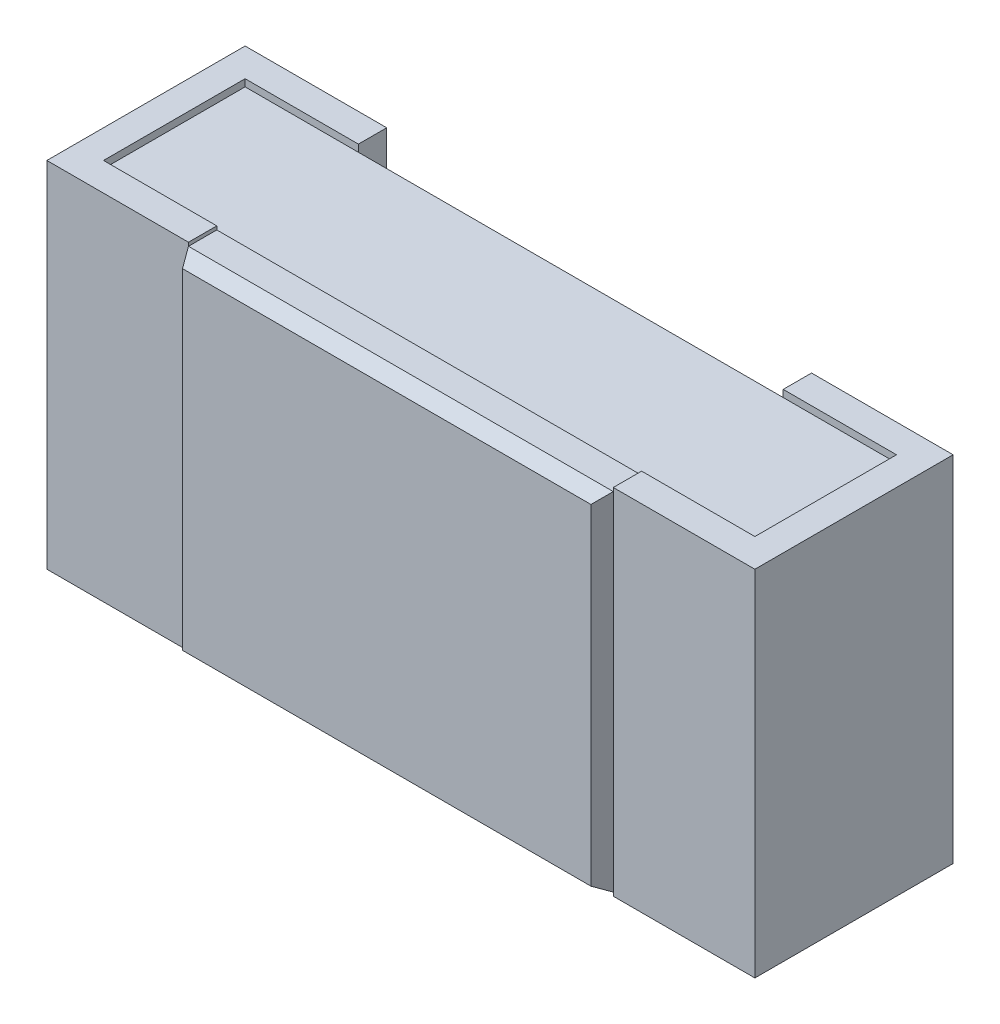
ISO-10303-21;
HEADER;
FILE_DESCRIPTION(('STEP AP214'),'2;1');
FILE_NAME('part.step','',(''),(''),'','','');
FILE_SCHEMA(('AUTOMOTIVE_DESIGN { 1 0 10303 214 1 1 1 1 }'));
ENDSEC;
DATA;
#1=APPLICATION_CONTEXT('core data for automotive mechanical design processes');
#2=APPLICATION_PROTOCOL_DEFINITION('international standard','automotive_design',2000,#1);
#3=PRODUCT_CONTEXT('',#1,'mechanical');
#4=PRODUCT('Part','Part','',(#3));
#5=PRODUCT_RELATED_PRODUCT_CATEGORY('part','',(#4));
#6=PRODUCT_DEFINITION_FORMATION('','',#4);
#7=PRODUCT_DEFINITION_CONTEXT('part definition',#1,'design');
#8=PRODUCT_DEFINITION('design','',#6,#7);
#9=PRODUCT_DEFINITION_SHAPE('','',#8);
#10=(LENGTH_UNIT() NAMED_UNIT(*) SI_UNIT(.MILLI.,.METRE.));
#11=(NAMED_UNIT(*) PLANE_ANGLE_UNIT() SI_UNIT($,.RADIAN.));
#12=(NAMED_UNIT(*) SI_UNIT($,.STERADIAN.) SOLID_ANGLE_UNIT());
#13=UNCERTAINTY_MEASURE_WITH_UNIT(LENGTH_MEASURE(1.E-05),#10,'distance_accuracy_value','');
#14=(GEOMETRIC_REPRESENTATION_CONTEXT(3) GLOBAL_UNCERTAINTY_ASSIGNED_CONTEXT((#13)) GLOBAL_UNIT_ASSIGNED_CONTEXT((#10,
#11,#12)) REPRESENTATION_CONTEXT('',''));
#15=CARTESIAN_POINT('',(0.,0.,0.));
#16=DIRECTION('',(0.,0.,1.));
#17=DIRECTION('',(1.,0.,0.));
#18=AXIS2_PLACEMENT_3D('',#15,#16,#17);
#19=CARTESIAN_POINT('',(-0.3,-0.25,0.28));
#20=DIRECTION('',(1.,0.,0.));
#21=DIRECTION('',(0.,0.,-1.));
#22=AXIS2_PLACEMENT_3D('',#19,#20,#21);
#23=PLANE('',#22);
#24=DIRECTION('',(0.,0.,1.));
#25=VECTOR('',#24,1.);
#26=CARTESIAN_POINT('',(-0.3,-0.245,0.24));
#27=LINE('',#26,#25);
#28=CARTESIAN_POINT('',(-0.3,-0.245,0.24));
#29=VERTEX_POINT('',#28);
#30=CARTESIAN_POINT('',(-0.3,-0.245,0.28));
#31=VERTEX_POINT('',#30);
#32=EDGE_CURVE('E294',#29,#31,#27,.T.);
#33=ORIENTED_EDGE('',*,*,#32,.T.);
#34=DIRECTION('',(0.,1.,0.));
#35=VECTOR('',#34,1.);
#36=CARTESIAN_POINT('',(-0.3,-0.25,0.28));
#37=LINE('',#36,#35);
#38=CARTESIAN_POINT('',(-0.3,-0.25,0.28));
#39=VERTEX_POINT('',#38);
#40=EDGE_CURVE('E486',#39,#31,#37,.T.);
#41=ORIENTED_EDGE('',*,*,#40,.F.);
#42=DIRECTION('',(0.,0.,-1.));
#43=VECTOR('',#42,1.);
#44=CARTESIAN_POINT('',(-0.3,-0.25,0.28));
#45=LINE('',#44,#43);
#46=CARTESIAN_POINT('',(-0.3,-0.25,0.24));
#47=VERTEX_POINT('',#46);
#48=EDGE_CURVE('E437',#39,#47,#45,.T.);
#49=ORIENTED_EDGE('',*,*,#48,.T.);
#50=DIRECTION('',(0.,1.,0.));
#51=VECTOR('',#50,1.);
#52=CARTESIAN_POINT('',(-0.3,-0.25,0.24));
#53=LINE('',#52,#51);
#54=EDGE_CURVE('E62',#47,#29,#53,.T.);
#55=ORIENTED_EDGE('',*,*,#54,.T.);
#56=EDGE_LOOP('',(#33,#41,#49,#55));
#57=FACE_BOUND('',#56,.T.);
#58=ADVANCED_FACE('F38',(#57),#23,.T.);
#59=CARTESIAN_POINT('',(0.3,-0.25,0.28));
#60=DIRECTION('',(-1.,0.,0.));
#61=DIRECTION('',(0.,0.,1.));
#62=AXIS2_PLACEMENT_3D('',#59,#60,#61);
#63=PLANE('',#62);
#64=DIRECTION('',(0.,0.,1.));
#65=VECTOR('',#64,1.);
#66=CARTESIAN_POINT('',(0.3,-0.245,0.24));
#67=LINE('',#66,#65);
#68=CARTESIAN_POINT('',(0.3,-0.245,0.24));
#69=VERTEX_POINT('',#68);
#70=CARTESIAN_POINT('',(0.3,-0.245,0.28));
#71=VERTEX_POINT('',#70);
#72=EDGE_CURVE('E290',#69,#71,#67,.T.);
#73=ORIENTED_EDGE('',*,*,#72,.F.);
#74=DIRECTION('',(0.,1.,0.));
#75=VECTOR('',#74,1.);
#76=CARTESIAN_POINT('',(0.3,-0.25,0.24));
#77=LINE('',#76,#75);
#78=CARTESIAN_POINT('',(0.3,-0.25,0.24));
#79=VERTEX_POINT('',#78);
#80=EDGE_CURVE('E365',#79,#69,#77,.T.);
#81=ORIENTED_EDGE('',*,*,#80,.F.);
#82=DIRECTION('',(0.,0.,1.));
#83=VECTOR('',#82,1.);
#84=CARTESIAN_POINT('',(0.3,-0.25,0.28));
#85=LINE('',#84,#83);
#86=CARTESIAN_POINT('',(0.3,-0.25,0.28));
#87=VERTEX_POINT('',#86);
#88=EDGE_CURVE('E332',#79,#87,#85,.T.);
#89=ORIENTED_EDGE('',*,*,#88,.T.);
#90=DIRECTION('',(0.,1.,0.));
#91=VECTOR('',#90,1.);
#92=CARTESIAN_POINT('',(0.3,-0.25,0.28));
#93=LINE('',#92,#91);
#94=EDGE_CURVE('E394',#87,#71,#93,.T.);
#95=ORIENTED_EDGE('',*,*,#94,.T.);
#96=EDGE_LOOP('',(#73,#81,#89,#95));
#97=FACE_BOUND('',#96,.T.);
#98=ADVANCED_FACE('F587',(#97),#63,.T.);
#99=CARTESIAN_POINT('',(-0.46,0.24,0.24));
#100=DIRECTION('',(0.,-1.,0.));
#101=DIRECTION('',(0.,0.,-1.));
#102=AXIS2_PLACEMENT_3D('',#99,#100,#101);
#103=PLANE('',#102);
#104=DIRECTION('',(-1.,0.,0.));
#105=VECTOR('',#104,1.);
#106=CARTESIAN_POINT('',(-0.46,0.24,0.04));
#107=LINE('',#106,#105);
#108=CARTESIAN_POINT('',(0.46,0.24,0.04));
#109=VERTEX_POINT('',#108);
#110=CARTESIAN_POINT('',(0.3,0.24,0.04));
#111=VERTEX_POINT('',#110);
#112=EDGE_CURVE('E501',#109,#111,#107,.T.);
#113=ORIENTED_EDGE('',*,*,#112,.T.);
#114=CARTESIAN_POINT('',(-0.3,0.24,0.04));
#115=VERTEX_POINT('',#114);
#116=EDGE_CURVE('E506',#111,#115,#107,.T.);
#117=ORIENTED_EDGE('',*,*,#116,.T.);
#118=CARTESIAN_POINT('',(-0.46,0.24,0.04));
#119=VERTEX_POINT('',#118);
#120=EDGE_CURVE('E464',#115,#119,#107,.T.);
#121=ORIENTED_EDGE('',*,*,#120,.T.);
#122=DIRECTION('',(0.,0.,-1.));
#123=VECTOR('',#122,1.);
#124=CARTESIAN_POINT('',(-0.46,0.24,0.24));
#125=LINE('',#124,#123);
#126=CARTESIAN_POINT('',(-0.46,0.24,0.24));
#127=VERTEX_POINT('',#126);
#128=EDGE_CURVE('E517',#127,#119,#125,.T.);
#129=ORIENTED_EDGE('',*,*,#128,.F.);
#130=DIRECTION('',(-1.,0.,0.));
#131=VECTOR('',#130,1.);
#132=CARTESIAN_POINT('',(-0.46,0.24,0.24));
#133=LINE('',#132,#131);
#134=CARTESIAN_POINT('',(0.46,0.24,0.24));
#135=VERTEX_POINT('',#134);
#136=EDGE_CURVE('E493',#135,#127,#133,.T.);
#137=ORIENTED_EDGE('',*,*,#136,.F.);
#138=DIRECTION('',(0.,0.,-1.));
#139=VECTOR('',#138,1.);
#140=CARTESIAN_POINT('',(0.46,0.24,0.24));
#141=LINE('',#140,#139);
#142=EDGE_CURVE('E520',#135,#109,#141,.T.);
#143=ORIENTED_EDGE('',*,*,#142,.T.);
#144=EDGE_LOOP('',(#113,#117,#121,#129,#137,#143));
#145=FACE_BOUND('',#144,.T.);
#146=ADVANCED_FACE('F40',(#145),#103,.F.);
#147=CARTESIAN_POINT('',(-0.46,-0.24,0.24));
#148=DIRECTION('',(0.,1.,0.));
#149=DIRECTION('',(0.,0.,1.));
#150=AXIS2_PLACEMENT_3D('',#147,#148,#149);
#151=PLANE('',#150);
#152=DIRECTION('',(1.,0.,0.));
#153=VECTOR('',#152,1.);
#154=CARTESIAN_POINT('',(-0.46,-0.24,0.04));
#155=LINE('',#154,#153);
#156=CARTESIAN_POINT('',(-0.46,-0.24,0.04));
#157=VERTEX_POINT('',#156);
#158=CARTESIAN_POINT('',(-0.3,-0.24,0.04));
#159=VERTEX_POINT('',#158);
#160=EDGE_CURVE('E497',#157,#159,#155,.T.);
#161=ORIENTED_EDGE('',*,*,#160,.T.);
#162=CARTESIAN_POINT('',(0.3,-0.24,0.04));
#163=VERTEX_POINT('',#162);
#164=EDGE_CURVE('E510',#159,#163,#155,.T.);
#165=ORIENTED_EDGE('',*,*,#164,.T.);
#166=CARTESIAN_POINT('',(0.46,-0.24,0.04));
#167=VERTEX_POINT('',#166);
#168=EDGE_CURVE('E505',#163,#167,#155,.T.);
#169=ORIENTED_EDGE('',*,*,#168,.T.);
#170=DIRECTION('',(0.,0.,-1.));
#171=VECTOR('',#170,1.);
#172=CARTESIAN_POINT('',(0.46,-0.24,0.24));
#173=LINE('',#172,#171);
#174=CARTESIAN_POINT('',(0.46,-0.24,0.24));
#175=VERTEX_POINT('',#174);
#176=EDGE_CURVE('E500',#175,#167,#173,.T.);
#177=ORIENTED_EDGE('',*,*,#176,.F.);
#178=DIRECTION('',(1.,0.,0.));
#179=VECTOR('',#178,1.);
#180=CARTESIAN_POINT('',(-0.46,-0.24,0.24));
#181=LINE('',#180,#179);
#182=CARTESIAN_POINT('',(-0.46,-0.24,0.24));
#183=VERTEX_POINT('',#182);
#184=EDGE_CURVE('E496',#183,#175,#181,.T.);
#185=ORIENTED_EDGE('',*,*,#184,.F.);
#186=DIRECTION('',(0.,0.,-1.));
#187=VECTOR('',#186,1.);
#188=CARTESIAN_POINT('',(-0.46,-0.24,0.24));
#189=LINE('',#188,#187);
#190=EDGE_CURVE('E513',#183,#157,#189,.T.);
#191=ORIENTED_EDGE('',*,*,#190,.T.);
#192=EDGE_LOOP('',(#161,#165,#169,#177,#185,#191));
#193=FACE_BOUND('',#192,.T.);
#194=ADVANCED_FACE('F553',(#193),#151,.F.);
#195=CARTESIAN_POINT('',(0.46,-0.24,0.04));
#196=DIRECTION('',(0.,0.,1.));
#197=DIRECTION('',(1.,0.,0.));
#198=AXIS2_PLACEMENT_3D('',#195,#196,#197);
#199=PLANE('',#198);
#200=ORIENTED_EDGE('',*,*,#116,.F.);
#201=DIRECTION('',(0.,-1.,0.));
#202=VECTOR('',#201,1.);
#203=CARTESIAN_POINT('',(0.3,-0.24,0.04));
#204=LINE('',#203,#202);
#205=EDGE_CURVE('E11',#111,#163,#204,.T.);
#206=ORIENTED_EDGE('',*,*,#205,.T.);
#207=ORIENTED_EDGE('',*,*,#164,.F.);
#208=DIRECTION('',(0.,1.,0.));
#209=VECTOR('',#208,1.);
#210=CARTESIAN_POINT('',(-0.3,-0.24,0.04));
#211=LINE('',#210,#209);
#212=EDGE_CURVE('E47',#159,#115,#211,.T.);
#213=ORIENTED_EDGE('',*,*,#212,.T.);
#214=EDGE_LOOP('',(#200,#206,#207,#213));
#215=FACE_BOUND('',#214,.T.);
#216=ADVANCED_FACE('F529',(#215),#199,.F.);
#217=CARTESIAN_POINT('',(-0.46,-0.25,0.04));
#218=DIRECTION('',(0.,0.,1.));
#219=DIRECTION('',(1.,0.,0.));
#220=AXIS2_PLACEMENT_3D('',#217,#218,#219);
#221=PLANE('',#220);
#222=ORIENTED_EDGE('',*,*,#120,.F.);
#223=DIRECTION('',(0.,1.,0.));
#224=VECTOR('',#223,1.);
#225=CARTESIAN_POINT('',(-0.3,-0.25,0.04));
#226=LINE('',#225,#224);
#227=CARTESIAN_POINT('',(-0.3,0.25,0.04));
#228=VERTEX_POINT('',#227);
#229=EDGE_CURVE('E472',#115,#228,#226,.T.);
#230=ORIENTED_EDGE('',*,*,#229,.T.);
#231=DIRECTION('',(1.,0.,0.));
#232=VECTOR('',#231,1.);
#233=CARTESIAN_POINT('',(-0.46,0.25,0.04));
#234=LINE('',#233,#232);
#235=CARTESIAN_POINT('',(-0.46,0.25,0.04));
#236=VERTEX_POINT('',#235);
#237=EDGE_CURVE('E417',#236,#228,#234,.T.);
#238=ORIENTED_EDGE('',*,*,#237,.F.);
#239=DIRECTION('',(0.,1.,0.));
#240=VECTOR('',#239,1.);
#241=CARTESIAN_POINT('',(-0.46,-0.25,0.04));
#242=LINE('',#241,#240);
#243=EDGE_CURVE('E477',#119,#236,#242,.T.);
#244=ORIENTED_EDGE('',*,*,#243,.F.);
#245=EDGE_LOOP('',(#222,#230,#238,#244));
#246=FACE_BOUND('',#245,.T.);
#247=ADVANCED_FACE('F640',(#246),#221,.T.);
#248=ORIENTED_EDGE('',*,*,#160,.F.);
#249=CARTESIAN_POINT('',(-0.46,-0.25,0.04));
#250=VERTEX_POINT('',#249);
#251=EDGE_CURVE('E473',#250,#157,#242,.T.);
#252=ORIENTED_EDGE('',*,*,#251,.F.);
#253=DIRECTION('',(1.,0.,0.));
#254=VECTOR('',#253,1.);
#255=CARTESIAN_POINT('',(-0.46,-0.25,0.04));
#256=LINE('',#255,#254);
#257=CARTESIAN_POINT('',(-0.3,-0.25,0.04));
#258=VERTEX_POINT('',#257);
#259=EDGE_CURVE('E448',#250,#258,#256,.T.);
#260=ORIENTED_EDGE('',*,*,#259,.T.);
#261=EDGE_CURVE('E468',#258,#159,#226,.T.);
#262=ORIENTED_EDGE('',*,*,#261,.T.);
#263=EDGE_LOOP('',(#248,#252,#260,#262));
#264=FACE_BOUND('',#263,.T.);
#265=ADVANCED_FACE('F538',(#264),#221,.T.);
#266=CARTESIAN_POINT('',(-0.3,-0.25,0.24));
#267=DIRECTION('',(0.,0.,-1.));
#268=DIRECTION('',(-1.,0.,0.));
#269=AXIS2_PLACEMENT_3D('',#266,#267,#268);
#270=PLANE('',#269);
#271=ORIENTED_EDGE('',*,*,#136,.T.);
#272=DIRECTION('',(0.,1.,0.));
#273=VECTOR('',#272,1.);
#274=CARTESIAN_POINT('',(-0.46,-0.25,0.24));
#275=LINE('',#274,#273);
#276=CARTESIAN_POINT('',(-0.46,0.25,0.24));
#277=VERTEX_POINT('',#276);
#278=EDGE_CURVE('E482',#127,#277,#275,.T.);
#279=ORIENTED_EDGE('',*,*,#278,.T.);
#280=DIRECTION('',(-1.,0.,0.));
#281=VECTOR('',#280,1.);
#282=CARTESIAN_POINT('',(-0.3,0.25,0.24));
#283=LINE('',#282,#281);
#284=CARTESIAN_POINT('',(-0.3,0.25,0.24));
#285=VERTEX_POINT('',#284);
#286=EDGE_CURVE('E409',#285,#277,#283,.T.);
#287=ORIENTED_EDGE('',*,*,#286,.F.);
#288=CARTESIAN_POINT('',(-0.3,0.245,0.24));
#289=VERTEX_POINT('',#288);
#290=EDGE_CURVE('E485',#289,#285,#53,.T.);
#291=ORIENTED_EDGE('',*,*,#290,.F.);
#292=DIRECTION('',(-1.,0.,0.));
#293=VECTOR('',#292,1.);
#294=CARTESIAN_POINT('',(-0.3,0.245,0.24));
#295=LINE('',#294,#293);
#296=CARTESIAN_POINT('',(0.3,0.245,0.24));
#297=VERTEX_POINT('',#296);
#298=EDGE_CURVE('E271',#297,#289,#295,.T.);
#299=ORIENTED_EDGE('',*,*,#298,.F.);
#300=CARTESIAN_POINT('',(0.3,0.25,0.24));
#301=VERTEX_POINT('',#300);
#302=EDGE_CURVE('E370',#297,#301,#77,.T.);
#303=ORIENTED_EDGE('',*,*,#302,.T.);
#304=DIRECTION('',(-1.,0.,0.));
#305=VECTOR('',#304,1.);
#306=CARTESIAN_POINT('',(0.3,0.25,0.24));
#307=LINE('',#306,#305);
#308=CARTESIAN_POINT('',(0.46,0.25,0.24));
#309=VERTEX_POINT('',#308);
#310=EDGE_CURVE('E328',#309,#301,#307,.T.);
#311=ORIENTED_EDGE('',*,*,#310,.F.);
#312=DIRECTION('',(0.,1.,0.));
#313=VECTOR('',#312,1.);
#314=CARTESIAN_POINT('',(0.46,-0.25,0.24));
#315=LINE('',#314,#313);
#316=EDGE_CURVE('E375',#135,#309,#315,.T.);
#317=ORIENTED_EDGE('',*,*,#316,.F.);
#318=EDGE_LOOP('',(#271,#279,#287,#291,#299,#303,#311,#317));
#319=FACE_BOUND('',#318,.T.);
#320=ADVANCED_FACE('F607',(#319),#270,.T.);
#321=ORIENTED_EDGE('',*,*,#184,.T.);
#322=CARTESIAN_POINT('',(0.46,-0.25,0.24));
#323=VERTEX_POINT('',#322);
#324=EDGE_CURVE('E371',#323,#175,#315,.T.);
#325=ORIENTED_EDGE('',*,*,#324,.F.);
#326=DIRECTION('',(-1.,0.,0.));
#327=VECTOR('',#326,1.);
#328=CARTESIAN_POINT('',(0.3,-0.25,0.24));
#329=LINE('',#328,#327);
#330=EDGE_CURVE('E360',#323,#79,#329,.T.);
#331=ORIENTED_EDGE('',*,*,#330,.T.);
#332=ORIENTED_EDGE('',*,*,#80,.T.);
#333=DIRECTION('',(1.,0.,0.));
#334=VECTOR('',#333,1.);
#335=CARTESIAN_POINT('',(-0.3,-0.245,0.24));
#336=LINE('',#335,#334);
#337=EDGE_CURVE('E275',#29,#69,#336,.T.);
#338=ORIENTED_EDGE('',*,*,#337,.F.);
#339=ORIENTED_EDGE('',*,*,#54,.F.);
#340=DIRECTION('',(-1.,0.,0.));
#341=VECTOR('',#340,1.);
#342=CARTESIAN_POINT('',(-0.3,-0.25,0.24));
#343=LINE('',#342,#341);
#344=CARTESIAN_POINT('',(-0.46,-0.25,0.24));
#345=VERTEX_POINT('',#344);
#346=EDGE_CURVE('E440',#47,#345,#343,.T.);
#347=ORIENTED_EDGE('',*,*,#346,.T.);
#348=EDGE_CURVE('E478',#345,#183,#275,.T.);
#349=ORIENTED_EDGE('',*,*,#348,.T.);
#350=EDGE_LOOP('',(#321,#325,#331,#332,#338,#339,#347,#349));
#351=FACE_BOUND('',#350,.T.);
#352=ADVANCED_FACE('F550',(#351),#270,.T.);
#353=CARTESIAN_POINT('',(-0.46,-0.25,0.04));
#354=DIRECTION('',(1.,0.,0.));
#355=DIRECTION('',(0.,0.,-1.));
#356=AXIS2_PLACEMENT_3D('',#353,#354,#355);
#357=PLANE('',#356);
#358=ORIENTED_EDGE('',*,*,#128,.T.);
#359=ORIENTED_EDGE('',*,*,#243,.T.);
#360=DIRECTION('',(0.,0.,-1.));
#361=VECTOR('',#360,1.);
#362=CARTESIAN_POINT('',(-0.46,0.25,0.04));
#363=LINE('',#362,#361);
#364=EDGE_CURVE('E413',#277,#236,#363,.T.);
#365=ORIENTED_EDGE('',*,*,#364,.F.);
#366=ORIENTED_EDGE('',*,*,#278,.F.);
#367=EDGE_LOOP('',(#358,#359,#365,#366));
#368=FACE_BOUND('',#367,.T.);
#369=ADVANCED_FACE('F636',(#368),#357,.T.);
#370=ORIENTED_EDGE('',*,*,#190,.F.);
#371=ORIENTED_EDGE('',*,*,#348,.F.);
#372=DIRECTION('',(0.,0.,-1.));
#373=VECTOR('',#372,1.);
#374=CARTESIAN_POINT('',(-0.46,-0.25,0.04));
#375=LINE('',#374,#373);
#376=EDGE_CURVE('E444',#345,#250,#375,.T.);
#377=ORIENTED_EDGE('',*,*,#376,.T.);
#378=ORIENTED_EDGE('',*,*,#251,.T.);
#379=EDGE_LOOP('',(#370,#371,#377,#378));
#380=FACE_BOUND('',#379,.T.);
#381=ADVANCED_FACE('F547',(#380),#357,.T.);
#382=CARTESIAN_POINT('',(-0.5,-0.25,0.));
#383=DIRECTION('',(-1.,0.,0.));
#384=DIRECTION('',(0.,0.,1.));
#385=AXIS2_PLACEMENT_3D('',#382,#383,#384);
#386=PLANE('',#385);
#387=DIRECTION('',(0.,1.,0.));
#388=VECTOR('',#387,1.);
#389=CARTESIAN_POINT('',(-0.5,-0.25,0.28));
#390=LINE('',#389,#388);
#391=CARTESIAN_POINT('',(-0.5,-0.25,0.28));
#392=VERTEX_POINT('',#391);
#393=CARTESIAN_POINT('',(-0.5,0.25,0.28));
#394=VERTEX_POINT('',#393);
#395=EDGE_CURVE('E460',#392,#394,#390,.T.);
#396=ORIENTED_EDGE('',*,*,#395,.T.);
#397=DIRECTION('',(0.,0.,1.));
#398=VECTOR('',#397,1.);
#399=CARTESIAN_POINT('',(-0.5,0.25,0.));
#400=LINE('',#399,#398);
#401=CARTESIAN_POINT('',(-0.5,0.25,0.));
#402=VERTEX_POINT('',#401);
#403=EDGE_CURVE('E369',#402,#394,#400,.T.);
#404=ORIENTED_EDGE('',*,*,#403,.F.);
#405=DIRECTION('',(0.,1.,0.));
#406=VECTOR('',#405,1.);
#407=CARTESIAN_POINT('',(-0.5,-0.25,0.));
#408=LINE('',#407,#406);
#409=CARTESIAN_POINT('',(-0.5,-0.25,0.));
#410=VERTEX_POINT('',#409);
#411=EDGE_CURVE('E461',#410,#402,#408,.T.);
#412=ORIENTED_EDGE('',*,*,#411,.F.);
#413=DIRECTION('',(0.,0.,1.));
#414=VECTOR('',#413,1.);
#415=CARTESIAN_POINT('',(-0.5,-0.25,0.));
#416=LINE('',#415,#414);
#417=EDGE_CURVE('E429',#410,#392,#416,.T.);
#418=ORIENTED_EDGE('',*,*,#417,.T.);
#419=EDGE_LOOP('',(#396,#404,#412,#418));
#420=FACE_BOUND('',#419,.T.);
#421=ADVANCED_FACE('F650',(#420),#386,.T.);
#422=CARTESIAN_POINT('',(-0.5,-0.25,0.));
#423=DIRECTION('',(0.,0.,-1.));
#424=DIRECTION('',(-1.,0.,0.));
#425=AXIS2_PLACEMENT_3D('',#422,#423,#424);
#426=PLANE('',#425);
#427=ORIENTED_EDGE('',*,*,#411,.T.);
#428=DIRECTION('',(-1.,0.,0.));
#429=VECTOR('',#428,1.);
#430=CARTESIAN_POINT('',(-0.5,0.25,0.));
#431=LINE('',#430,#429);
#432=CARTESIAN_POINT('',(-0.3,0.25,0.));
#433=VERTEX_POINT('',#432);
#434=EDGE_CURVE('E425',#433,#402,#431,.T.);
#435=ORIENTED_EDGE('',*,*,#434,.F.);
#436=DIRECTION('',(0.,1.,0.));
#437=VECTOR('',#436,1.);
#438=CARTESIAN_POINT('',(-0.3,-0.25,0.));
#439=LINE('',#438,#437);
#440=CARTESIAN_POINT('',(-0.3,-0.25,0.));
#441=VERTEX_POINT('',#440);
#442=EDGE_CURVE('E465',#441,#433,#439,.T.);
#443=ORIENTED_EDGE('',*,*,#442,.F.);
#444=DIRECTION('',(-1.,0.,0.));
#445=VECTOR('',#444,1.);
#446=CARTESIAN_POINT('',(-0.5,-0.25,0.));
#447=LINE('',#446,#445);
#448=EDGE_CURVE('E456',#441,#410,#447,.T.);
#449=ORIENTED_EDGE('',*,*,#448,.T.);
#450=EDGE_LOOP('',(#427,#435,#443,#449));
#451=FACE_BOUND('',#450,.T.);
#452=ADVANCED_FACE('F647',(#451),#426,.T.);
#453=CARTESIAN_POINT('',(-0.3,-0.25,0.));
#454=DIRECTION('',(1.,0.,0.));
#455=DIRECTION('',(0.,0.,-1.));
#456=AXIS2_PLACEMENT_3D('',#453,#454,#455);
#457=PLANE('',#456);
#458=ORIENTED_EDGE('',*,*,#442,.T.);
#459=DIRECTION('',(0.,0.,-1.));
#460=VECTOR('',#459,1.);
#461=CARTESIAN_POINT('',(-0.3,0.25,0.));
#462=LINE('',#461,#460);
#463=EDGE_CURVE('E421',#228,#433,#462,.T.);
#464=ORIENTED_EDGE('',*,*,#463,.F.);
#465=ORIENTED_EDGE('',*,*,#229,.F.);
#466=ORIENTED_EDGE('',*,*,#212,.F.);
#467=ORIENTED_EDGE('',*,*,#261,.F.);
#468=DIRECTION('',(0.,0.,-1.));
#469=VECTOR('',#468,1.);
#470=CARTESIAN_POINT('',(-0.3,-0.25,0.));
#471=LINE('',#470,#469);
#472=EDGE_CURVE('E452',#258,#441,#471,.T.);
#473=ORIENTED_EDGE('',*,*,#472,.T.);
#474=EDGE_LOOP('',(#458,#464,#465,#466,#467,#473));
#475=FACE_BOUND('',#474,.T.);
#476=ADVANCED_FACE('F533',(#475),#457,.T.);
#477=DIRECTION('',(0.,0.,1.));
#478=VECTOR('',#477,1.);
#479=CARTESIAN_POINT('',(-0.3,0.245,0.24));
#480=LINE('',#479,#478);
#481=CARTESIAN_POINT('',(-0.3,0.245,0.28));
#482=VERTEX_POINT('',#481);
#483=EDGE_CURVE('E54',#289,#482,#480,.T.);
#484=ORIENTED_EDGE('',*,*,#483,.F.);
#485=ORIENTED_EDGE('',*,*,#290,.T.);
#486=DIRECTION('',(0.,0.,-1.));
#487=VECTOR('',#486,1.);
#488=CARTESIAN_POINT('',(-0.3,0.25,0.28));
#489=LINE('',#488,#487);
#490=CARTESIAN_POINT('',(-0.3,0.25,0.28));
#491=VERTEX_POINT('',#490);
#492=EDGE_CURVE('E405',#491,#285,#489,.T.);
#493=ORIENTED_EDGE('',*,*,#492,.F.);
#494=EDGE_CURVE('E490',#482,#491,#37,.T.);
#495=ORIENTED_EDGE('',*,*,#494,.F.);
#496=EDGE_LOOP('',(#484,#485,#493,#495));
#497=FACE_BOUND('',#496,.T.);
#498=ADVANCED_FACE('F652',(#497),#23,.T.);
#499=CARTESIAN_POINT('',(-0.5,-0.25,0.28));
#500=DIRECTION('',(0.,0.,1.));
#501=DIRECTION('',(1.,0.,0.));
#502=AXIS2_PLACEMENT_3D('',#499,#500,#501);
#503=PLANE('',#502);
#504=ORIENTED_EDGE('',*,*,#40,.T.);
#505=DIRECTION('',(0.,-1.,0.));
#506=VECTOR('',#505,1.);
#507=CARTESIAN_POINT('',(-0.3,0.245,0.28));
#508=LINE('',#507,#506);
#509=EDGE_CURVE('E283',#482,#31,#508,.T.);
#510=ORIENTED_EDGE('',*,*,#509,.F.);
#511=ORIENTED_EDGE('',*,*,#494,.T.);
#512=DIRECTION('',(1.,0.,0.));
#513=VECTOR('',#512,1.);
#514=CARTESIAN_POINT('',(-0.5,0.25,0.28));
#515=LINE('',#514,#513);
#516=EDGE_CURVE('E401',#394,#491,#515,.T.);
#517=ORIENTED_EDGE('',*,*,#516,.F.);
#518=ORIENTED_EDGE('',*,*,#395,.F.);
#519=DIRECTION('',(1.,0.,0.));
#520=VECTOR('',#519,1.);
#521=CARTESIAN_POINT('',(-0.5,-0.25,0.28));
#522=LINE('',#521,#520);
#523=EDGE_CURVE('E433',#392,#39,#522,.T.);
#524=ORIENTED_EDGE('',*,*,#523,.T.);
#525=EDGE_LOOP('',(#504,#510,#511,#517,#518,#524));
#526=FACE_BOUND('',#525,.T.);
#527=ADVANCED_FACE('F599',(#526),#503,.T.);
#528=CARTESIAN_POINT('',(-0.5,-0.25,0.28));
#529=DIRECTION('',(0.,1.,0.));
#530=DIRECTION('',(0.,0.,1.));
#531=AXIS2_PLACEMENT_3D('',#528,#529,#530);
#532=PLANE('',#531);
#533=ORIENTED_EDGE('',*,*,#417,.F.);
#534=ORIENTED_EDGE('',*,*,#448,.F.);
#535=ORIENTED_EDGE('',*,*,#472,.F.);
#536=ORIENTED_EDGE('',*,*,#259,.F.);
#537=ORIENTED_EDGE('',*,*,#376,.F.);
#538=ORIENTED_EDGE('',*,*,#346,.F.);
#539=ORIENTED_EDGE('',*,*,#48,.F.);
#540=ORIENTED_EDGE('',*,*,#523,.F.);
#541=EDGE_LOOP('',(#533,#534,#535,#536,#537,#538,#539,#540));
#542=FACE_BOUND('',#541,.T.);
#543=ADVANCED_FACE('F543',(#542),#532,.F.);
#544=CARTESIAN_POINT('',(-0.5,0.25,0.28));
#545=DIRECTION('',(0.,1.,0.));
#546=DIRECTION('',(0.,0.,1.));
#547=AXIS2_PLACEMENT_3D('',#544,#545,#546);
#548=PLANE('',#547);
#549=ORIENTED_EDGE('',*,*,#403,.T.);
#550=ORIENTED_EDGE('',*,*,#516,.T.);
#551=ORIENTED_EDGE('',*,*,#492,.T.);
#552=ORIENTED_EDGE('',*,*,#286,.T.);
#553=ORIENTED_EDGE('',*,*,#364,.T.);
#554=ORIENTED_EDGE('',*,*,#237,.T.);
#555=ORIENTED_EDGE('',*,*,#463,.T.);
#556=ORIENTED_EDGE('',*,*,#434,.T.);
#557=EDGE_LOOP('',(#549,#550,#551,#552,#553,#554,#555,#556));
#558=FACE_BOUND('',#557,.T.);
#559=ADVANCED_FACE('F644',(#558),#548,.T.);
#560=CARTESIAN_POINT('',(0.46,-0.25,0.04));
#561=DIRECTION('',(0.,0.,1.));
#562=DIRECTION('',(1.,0.,0.));
#563=AXIS2_PLACEMENT_3D('',#560,#561,#562);
#564=PLANE('',#563);
#565=ORIENTED_EDGE('',*,*,#112,.F.);
#566=DIRECTION('',(0.,1.,0.));
#567=VECTOR('',#566,1.);
#568=CARTESIAN_POINT('',(0.46,-0.25,0.04));
#569=LINE('',#568,#567);
#570=CARTESIAN_POINT('',(0.46,0.25,0.04));
#571=VERTEX_POINT('',#570);
#572=EDGE_CURVE('E380',#109,#571,#569,.T.);
#573=ORIENTED_EDGE('',*,*,#572,.T.);
#574=DIRECTION('',(1.,0.,0.));
#575=VECTOR('',#574,1.);
#576=CARTESIAN_POINT('',(0.46,0.25,0.04));
#577=LINE('',#576,#575);
#578=CARTESIAN_POINT('',(0.3,0.25,0.04));
#579=VERTEX_POINT('',#578);
#580=EDGE_CURVE('E320',#579,#571,#577,.T.);
#581=ORIENTED_EDGE('',*,*,#580,.F.);
#582=DIRECTION('',(0.,1.,0.));
#583=VECTOR('',#582,1.);
#584=CARTESIAN_POINT('',(0.3,-0.25,0.04));
#585=LINE('',#584,#583);
#586=EDGE_CURVE('E384',#111,#579,#585,.T.);
#587=ORIENTED_EDGE('',*,*,#586,.F.);
#588=EDGE_LOOP('',(#565,#573,#581,#587));
#589=FACE_BOUND('',#588,.T.);
#590=ADVANCED_FACE('F622',(#589),#564,.T.);
#591=ORIENTED_EDGE('',*,*,#168,.F.);
#592=CARTESIAN_POINT('',(0.3,-0.25,0.04));
#593=VERTEX_POINT('',#592);
#594=EDGE_CURVE('E381',#593,#163,#585,.T.);
#595=ORIENTED_EDGE('',*,*,#594,.F.);
#596=DIRECTION('',(1.,0.,0.));
#597=VECTOR('',#596,1.);
#598=CARTESIAN_POINT('',(0.46,-0.25,0.04));
#599=LINE('',#598,#597);
#600=CARTESIAN_POINT('',(0.46,-0.25,0.04));
#601=VERTEX_POINT('',#600);
#602=EDGE_CURVE('E352',#593,#601,#599,.T.);
#603=ORIENTED_EDGE('',*,*,#602,.T.);
#604=EDGE_CURVE('E376',#601,#167,#569,.T.);
#605=ORIENTED_EDGE('',*,*,#604,.T.);
#606=EDGE_LOOP('',(#591,#595,#603,#605));
#607=FACE_BOUND('',#606,.T.);
#608=ADVANCED_FACE('F560',(#607),#564,.T.);
#609=CARTESIAN_POINT('',(0.46,-0.25,0.04));
#610=DIRECTION('',(-1.,0.,0.));
#611=DIRECTION('',(0.,0.,1.));
#612=AXIS2_PLACEMENT_3D('',#609,#610,#611);
#613=PLANE('',#612);
#614=ORIENTED_EDGE('',*,*,#142,.F.);
#615=ORIENTED_EDGE('',*,*,#316,.T.);
#616=DIRECTION('',(0.,0.,1.));
#617=VECTOR('',#616,1.);
#618=CARTESIAN_POINT('',(0.46,0.25,0.04));
#619=LINE('',#618,#617);
#620=EDGE_CURVE('E324',#571,#309,#619,.T.);
#621=ORIENTED_EDGE('',*,*,#620,.F.);
#622=ORIENTED_EDGE('',*,*,#572,.F.);
#623=EDGE_LOOP('',(#614,#615,#621,#622));
#624=FACE_BOUND('',#623,.T.);
#625=ADVANCED_FACE('F625',(#624),#613,.T.);
#626=ORIENTED_EDGE('',*,*,#176,.T.);
#627=ORIENTED_EDGE('',*,*,#604,.F.);
#628=DIRECTION('',(0.,0.,1.));
#629=VECTOR('',#628,1.);
#630=CARTESIAN_POINT('',(0.46,-0.25,0.04));
#631=LINE('',#630,#629);
#632=EDGE_CURVE('E356',#601,#323,#631,.T.);
#633=ORIENTED_EDGE('',*,*,#632,.T.);
#634=ORIENTED_EDGE('',*,*,#324,.T.);
#635=EDGE_LOOP('',(#626,#627,#633,#634));
#636=FACE_BOUND('',#635,.T.);
#637=ADVANCED_FACE('F557',(#636),#613,.T.);
#638=DIRECTION('',(0.,0.,1.));
#639=VECTOR('',#638,1.);
#640=CARTESIAN_POINT('',(0.3,0.245,0.24));
#641=LINE('',#640,#639);
#642=CARTESIAN_POINT('',(0.3,0.245,0.28));
#643=VERTEX_POINT('',#642);
#644=EDGE_CURVE('E279',#297,#643,#641,.T.);
#645=ORIENTED_EDGE('',*,*,#644,.T.);
#646=CARTESIAN_POINT('',(0.3,0.25,0.28));
#647=VERTEX_POINT('',#646);
#648=EDGE_CURVE('E364',#643,#647,#93,.T.);
#649=ORIENTED_EDGE('',*,*,#648,.T.);
#650=DIRECTION('',(0.,0.,1.));
#651=VECTOR('',#650,1.);
#652=CARTESIAN_POINT('',(0.3,0.25,0.28));
#653=LINE('',#652,#651);
#654=EDGE_CURVE('E293',#301,#647,#653,.T.);
#655=ORIENTED_EDGE('',*,*,#654,.F.);
#656=ORIENTED_EDGE('',*,*,#302,.F.);
#657=EDGE_LOOP('',(#645,#649,#655,#656));
#658=FACE_BOUND('',#657,.T.);
#659=ADVANCED_FACE('F632',(#658),#63,.T.);
#660=CARTESIAN_POINT('',(0.3,-0.25,0.));
#661=DIRECTION('',(-1.,0.,0.));
#662=DIRECTION('',(0.,0.,1.));
#663=AXIS2_PLACEMENT_3D('',#660,#661,#662);
#664=PLANE('',#663);
#665=ORIENTED_EDGE('',*,*,#594,.T.);
#666=ORIENTED_EDGE('',*,*,#205,.F.);
#667=ORIENTED_EDGE('',*,*,#586,.T.);
#668=DIRECTION('',(0.,0.,1.));
#669=VECTOR('',#668,1.);
#670=CARTESIAN_POINT('',(0.3,0.25,0.));
#671=LINE('',#670,#669);
#672=CARTESIAN_POINT('',(0.3,0.25,0.));
#673=VERTEX_POINT('',#672);
#674=EDGE_CURVE('E316',#673,#579,#671,.T.);
#675=ORIENTED_EDGE('',*,*,#674,.F.);
#676=DIRECTION('',(0.,1.,0.));
#677=VECTOR('',#676,1.);
#678=CARTESIAN_POINT('',(0.3,-0.25,0.));
#679=LINE('',#678,#677);
#680=CARTESIAN_POINT('',(0.3,-0.25,0.));
#681=VERTEX_POINT('',#680);
#682=EDGE_CURVE('E385',#681,#673,#679,.T.);
#683=ORIENTED_EDGE('',*,*,#682,.F.);
#684=DIRECTION('',(0.,0.,1.));
#685=VECTOR('',#684,1.);
#686=CARTESIAN_POINT('',(0.3,-0.25,0.));
#687=LINE('',#686,#685);
#688=EDGE_CURVE('E348',#681,#593,#687,.T.);
#689=ORIENTED_EDGE('',*,*,#688,.T.);
#690=EDGE_LOOP('',(#665,#666,#667,#675,#683,#689));
#691=FACE_BOUND('',#690,.T.);
#692=ADVANCED_FACE('F569',(#691),#664,.T.);
#693=CARTESIAN_POINT('',(0.5,-0.25,0.));
#694=DIRECTION('',(0.,0.,-1.));
#695=DIRECTION('',(-1.,0.,0.));
#696=AXIS2_PLACEMENT_3D('',#693,#694,#695);
#697=PLANE('',#696);
#698=ORIENTED_EDGE('',*,*,#682,.T.);
#699=DIRECTION('',(-1.,0.,0.));
#700=VECTOR('',#699,1.);
#701=CARTESIAN_POINT('',(0.5,0.25,0.));
#702=LINE('',#701,#700);
#703=CARTESIAN_POINT('',(0.5,0.25,0.));
#704=VERTEX_POINT('',#703);
#705=EDGE_CURVE('E312',#704,#673,#702,.T.);
#706=ORIENTED_EDGE('',*,*,#705,.F.);
#707=DIRECTION('',(0.,1.,0.));
#708=VECTOR('',#707,1.);
#709=CARTESIAN_POINT('',(0.5,-0.25,0.));
#710=LINE('',#709,#708);
#711=CARTESIAN_POINT('',(0.5,-0.25,0.));
#712=VERTEX_POINT('',#711);
#713=EDGE_CURVE('E388',#712,#704,#710,.T.);
#714=ORIENTED_EDGE('',*,*,#713,.F.);
#715=DIRECTION('',(-1.,0.,0.));
#716=VECTOR('',#715,1.);
#717=CARTESIAN_POINT('',(0.5,-0.25,0.));
#718=LINE('',#717,#716);
#719=EDGE_CURVE('E344',#712,#681,#718,.T.);
#720=ORIENTED_EDGE('',*,*,#719,.T.);
#721=EDGE_LOOP('',(#698,#706,#714,#720));
#722=FACE_BOUND('',#721,.T.);
#723=ADVANCED_FACE('F574',(#722),#697,.T.);
#724=CARTESIAN_POINT('',(0.5,-0.25,0.));
#725=DIRECTION('',(1.,0.,0.));
#726=DIRECTION('',(0.,0.,-1.));
#727=AXIS2_PLACEMENT_3D('',#724,#725,#726);
#728=PLANE('',#727);
#729=ORIENTED_EDGE('',*,*,#713,.T.);
#730=DIRECTION('',(0.,0.,-1.));
#731=VECTOR('',#730,1.);
#732=CARTESIAN_POINT('',(0.5,0.25,0.));
#733=LINE('',#732,#731);
#734=CARTESIAN_POINT('',(0.5,0.25,0.28));
#735=VERTEX_POINT('',#734);
#736=EDGE_CURVE('E309',#735,#704,#733,.T.);
#737=ORIENTED_EDGE('',*,*,#736,.F.);
#738=DIRECTION('',(0.,1.,0.));
#739=VECTOR('',#738,1.);
#740=CARTESIAN_POINT('',(0.5,-0.25,0.28));
#741=LINE('',#740,#739);
#742=CARTESIAN_POINT('',(0.5,-0.25,0.28));
#743=VERTEX_POINT('',#742);
#744=EDGE_CURVE('E391',#743,#735,#741,.T.);
#745=ORIENTED_EDGE('',*,*,#744,.F.);
#746=DIRECTION('',(0.,0.,-1.));
#747=VECTOR('',#746,1.);
#748=CARTESIAN_POINT('',(0.5,-0.25,0.));
#749=LINE('',#748,#747);
#750=EDGE_CURVE('E340',#743,#712,#749,.T.);
#751=ORIENTED_EDGE('',*,*,#750,.T.);
#752=EDGE_LOOP('',(#729,#737,#745,#751));
#753=FACE_BOUND('',#752,.T.);
#754=ADVANCED_FACE('F581',(#753),#728,.T.);
#755=CARTESIAN_POINT('',(0.5,-0.25,0.28));
#756=DIRECTION('',(0.,0.,1.));
#757=DIRECTION('',(1.,0.,0.));
#758=AXIS2_PLACEMENT_3D('',#755,#756,#757);
#759=PLANE('',#758);
#760=ORIENTED_EDGE('',*,*,#744,.T.);
#761=DIRECTION('',(1.,0.,0.));
#762=VECTOR('',#761,1.);
#763=CARTESIAN_POINT('',(0.5,0.25,0.28));
#764=LINE('',#763,#762);
#765=EDGE_CURVE('E305',#647,#735,#764,.T.);
#766=ORIENTED_EDGE('',*,*,#765,.F.);
#767=ORIENTED_EDGE('',*,*,#648,.F.);
#768=DIRECTION('',(0.,1.,0.));
#769=VECTOR('',#768,1.);
#770=CARTESIAN_POINT('',(0.3,0.245,0.28));
#771=LINE('',#770,#769);
#772=EDGE_CURVE('E249',#71,#643,#771,.T.);
#773=ORIENTED_EDGE('',*,*,#772,.F.);
#774=ORIENTED_EDGE('',*,*,#94,.F.);
#775=DIRECTION('',(1.,0.,0.));
#776=VECTOR('',#775,1.);
#777=CARTESIAN_POINT('',(0.5,-0.25,0.28));
#778=LINE('',#777,#776);
#779=EDGE_CURVE('E336',#87,#743,#778,.T.);
#780=ORIENTED_EDGE('',*,*,#779,.T.);
#781=EDGE_LOOP('',(#760,#766,#767,#773,#774,#780));
#782=FACE_BOUND('',#781,.T.);
#783=ADVANCED_FACE('F585',(#782),#759,.T.);
#784=CARTESIAN_POINT('',(0.3,-0.25,0.24));
#785=DIRECTION('',(0.,-1.,0.));
#786=DIRECTION('',(0.,0.,-1.));
#787=AXIS2_PLACEMENT_3D('',#784,#785,#786);
#788=PLANE('',#787);
#789=ORIENTED_EDGE('',*,*,#88,.F.);
#790=ORIENTED_EDGE('',*,*,#330,.F.);
#791=ORIENTED_EDGE('',*,*,#632,.F.);
#792=ORIENTED_EDGE('',*,*,#602,.F.);
#793=ORIENTED_EDGE('',*,*,#688,.F.);
#794=ORIENTED_EDGE('',*,*,#719,.F.);
#795=ORIENTED_EDGE('',*,*,#750,.F.);
#796=ORIENTED_EDGE('',*,*,#779,.F.);
#797=EDGE_LOOP('',(#789,#790,#791,#792,#793,#794,#795,#796));
#798=FACE_BOUND('',#797,.T.);
#799=ADVANCED_FACE('F565',(#798),#788,.T.);
#800=CARTESIAN_POINT('',(0.3,0.25,0.24));
#801=DIRECTION('',(0.,-1.,0.));
#802=DIRECTION('',(0.,0.,-1.));
#803=AXIS2_PLACEMENT_3D('',#800,#801,#802);
#804=PLANE('',#803);
#805=ORIENTED_EDGE('',*,*,#654,.T.);
#806=ORIENTED_EDGE('',*,*,#765,.T.);
#807=ORIENTED_EDGE('',*,*,#736,.T.);
#808=ORIENTED_EDGE('',*,*,#705,.T.);
#809=ORIENTED_EDGE('',*,*,#674,.T.);
#810=ORIENTED_EDGE('',*,*,#580,.T.);
#811=ORIENTED_EDGE('',*,*,#620,.T.);
#812=ORIENTED_EDGE('',*,*,#310,.T.);
#813=EDGE_LOOP('',(#805,#806,#807,#808,#809,#810,#811,#812));
#814=FACE_BOUND('',#813,.T.);
#815=ADVANCED_FACE('F576',(#814),#804,.F.);
#816=CARTESIAN_POINT('',(-0.3,-0.245,0.24));
#817=DIRECTION('',(0.,-1.,0.));
#818=DIRECTION('',(0.,0.,-1.));
#819=AXIS2_PLACEMENT_3D('',#816,#817,#818);
#820=PLANE('',#819);
#821=DIRECTION('',(1.,0.,0.));
#822=VECTOR('',#821,1.);
#823=CARTESIAN_POINT('',(-0.3,-0.245,0.28));
#824=LINE('',#823,#822);
#825=EDGE_CURVE('E276',#31,#71,#824,.T.);
#826=ORIENTED_EDGE('',*,*,#825,.F.);
#827=ORIENTED_EDGE('',*,*,#32,.F.);
#828=ORIENTED_EDGE('',*,*,#337,.T.);
#829=ORIENTED_EDGE('',*,*,#72,.T.);
#830=EDGE_LOOP('',(#826,#827,#828,#829));
#831=FACE_BOUND('',#830,.T.);
#832=ADVANCED_FACE('F590',(#831),#820,.T.);
#833=CARTESIAN_POINT('',(-0.3,0.245,0.24));
#834=DIRECTION('',(0.,1.,0.));
#835=DIRECTION('',(0.,0.,1.));
#836=AXIS2_PLACEMENT_3D('',#833,#834,#835);
#837=PLANE('',#836);
#838=DIRECTION('',(-1.,0.,0.));
#839=VECTOR('',#838,1.);
#840=CARTESIAN_POINT('',(-0.3,0.245,0.28));
#841=LINE('',#840,#839);
#842=EDGE_CURVE('E255',#643,#482,#841,.T.);
#843=ORIENTED_EDGE('',*,*,#842,.F.);
#844=ORIENTED_EDGE('',*,*,#644,.F.);
#845=ORIENTED_EDGE('',*,*,#298,.T.);
#846=ORIENTED_EDGE('',*,*,#483,.T.);
#847=EDGE_LOOP('',(#843,#844,#845,#846));
#848=FACE_BOUND('',#847,.T.);
#849=ADVANCED_FACE('F603',(#848),#837,.T.);
#850=CARTESIAN_POINT('',(0.3,0.245,0.28));
#851=DIRECTION('',(0.866025403784438,0.,0.500000000000001));
#852=DIRECTION('',(0.500000000000001,0.,-0.866025403784438));
#853=AXIS2_PLACEMENT_3D('',#850,#851,#852);
#854=PLANE('',#853);
#855=ORIENTED_EDGE('',*,*,#772,.T.);
#856=DIRECTION('',(0.447213595499959,0.447213595499959,-0.774596669241482));
#857=VECTOR('',#856,1.);
#858=CARTESIAN_POINT('',(0.18,0.125,0.487846096908265));
#859=LINE('',#858,#857);
#860=CARTESIAN_POINT('',(0.288452994616207,0.233452994616207,0.3));
#861=VERTEX_POINT('',#860);
#862=EDGE_CURVE('E229',#861,#643,#859,.T.);
#863=ORIENTED_EDGE('',*,*,#862,.F.);
#864=DIRECTION('',(0.,-1.,0.));
#865=VECTOR('',#864,1.);
#866=CARTESIAN_POINT('',(0.288452994616207,0.245,0.3));
#867=LINE('',#866,#865);
#868=CARTESIAN_POINT('',(0.288452994616207,-0.233452994616207,0.3));
#869=VERTEX_POINT('',#868);
#870=EDGE_CURVE('E237',#869,#861,#867,.F.);
#871=ORIENTED_EDGE('',*,*,#870,.F.);
#872=DIRECTION('',(0.447213595499958,-0.447213595499959,-0.774596669241482));
#873=VECTOR('',#872,1.);
#874=CARTESIAN_POINT('',(0.202,-0.147,0.44974097914175));
#875=LINE('',#874,#873);
#876=EDGE_CURVE('E261',#869,#71,#875,.T.);
#877=ORIENTED_EDGE('',*,*,#876,.T.);
#878=EDGE_LOOP('',(#855,#863,#871,#877));
#879=FACE_BOUND('',#878,.T.);
#880=ADVANCED_FACE('F248',(#879),#854,.T.);
#881=CARTESIAN_POINT('',(-0.3,0.245,0.28));
#882=DIRECTION('',(0.,0.866025403784438,0.500000000000001));
#883=DIRECTION('',(0.,-0.500000000000001,0.866025403784438));
#884=AXIS2_PLACEMENT_3D('',#881,#882,#883);
#885=PLANE('',#884);
#886=ORIENTED_EDGE('',*,*,#842,.T.);
#887=DIRECTION('',(-0.447213595499959,0.447213595499959,-0.774596669241482));
#888=VECTOR('',#887,1.);
#889=CARTESIAN_POINT('',(-0.3,0.245,0.28));
#890=LINE('',#889,#888);
#891=CARTESIAN_POINT('',(-0.288452994616207,0.233452994616207,0.3));
#892=VERTEX_POINT('',#891);
#893=EDGE_CURVE('E232',#892,#482,#890,.T.);
#894=ORIENTED_EDGE('',*,*,#893,.F.);
#895=DIRECTION('',(1.,0.,0.));
#896=VECTOR('',#895,1.);
#897=CARTESIAN_POINT('',(-0.3,0.233452994616207,0.3));
#898=LINE('',#897,#896);
#899=EDGE_CURVE('E224',#861,#892,#898,.F.);
#900=ORIENTED_EDGE('',*,*,#899,.F.);
#901=ORIENTED_EDGE('',*,*,#862,.T.);
#902=EDGE_LOOP('',(#886,#894,#900,#901));
#903=FACE_BOUND('',#902,.T.);
#904=ADVANCED_FACE('F227',(#903),#885,.T.);
#905=CARTESIAN_POINT('',(-0.3,0.245,0.28));
#906=DIRECTION('',(-0.866025403784438,0.,0.500000000000001));
#907=DIRECTION('',(0.500000000000001,0.,0.866025403784438));
#908=AXIS2_PLACEMENT_3D('',#905,#906,#907);
#909=PLANE('',#908);
#910=ORIENTED_EDGE('',*,*,#509,.T.);
#911=DIRECTION('',(-0.447213595499959,-0.447213595499959,-0.774596669241482));
#912=VECTOR('',#911,1.);
#913=CARTESIAN_POINT('',(-0.3,-0.245,0.28));
#914=LINE('',#913,#912);
#915=CARTESIAN_POINT('',(-0.288452994616207,-0.233452994616207,0.3));
#916=VERTEX_POINT('',#915);
#917=EDGE_CURVE('E258',#916,#31,#914,.T.);
#918=ORIENTED_EDGE('',*,*,#917,.F.);
#919=DIRECTION('',(0.,1.,0.));
#920=VECTOR('',#919,1.);
#921=CARTESIAN_POINT('',(-0.288452994616207,0.245,0.3));
#922=LINE('',#921,#920);
#923=EDGE_CURVE('E236',#892,#916,#922,.F.);
#924=ORIENTED_EDGE('',*,*,#923,.F.);
#925=ORIENTED_EDGE('',*,*,#893,.T.);
#926=EDGE_LOOP('',(#910,#918,#924,#925));
#927=FACE_BOUND('',#926,.T.);
#928=ADVANCED_FACE('F596',(#927),#909,.T.);
#929=CARTESIAN_POINT('',(-0.3,-0.245,0.28));
#930=DIRECTION('',(0.,-0.866025403784438,0.500000000000001));
#931=DIRECTION('',(0.,-0.500000000000001,-0.866025403784438));
#932=AXIS2_PLACEMENT_3D('',#929,#930,#931);
#933=PLANE('',#932);
#934=ORIENTED_EDGE('',*,*,#825,.T.);
#935=ORIENTED_EDGE('',*,*,#876,.F.);
#936=DIRECTION('',(-1.,0.,0.));
#937=VECTOR('',#936,1.);
#938=CARTESIAN_POINT('',(-0.3,-0.233452994616207,0.3));
#939=LINE('',#938,#937);
#940=EDGE_CURVE('E242',#916,#869,#939,.F.);
#941=ORIENTED_EDGE('',*,*,#940,.F.);
#942=ORIENTED_EDGE('',*,*,#917,.T.);
#943=EDGE_LOOP('',(#934,#935,#941,#942));
#944=FACE_BOUND('',#943,.T.);
#945=ADVANCED_FACE('F593',(#944),#933,.T.);
#946=CARTESIAN_POINT('',(0.3,-0.245,0.3));
#947=DIRECTION('',(0.,0.,1.));
#948=DIRECTION('',(1.,0.,0.));
#949=AXIS2_PLACEMENT_3D('',#946,#947,#948);
#950=PLANE('',#949);
#951=ORIENTED_EDGE('',*,*,#870,.T.);
#952=ORIENTED_EDGE('',*,*,#899,.T.);
#953=ORIENTED_EDGE('',*,*,#923,.T.);
#954=ORIENTED_EDGE('',*,*,#940,.T.);
#955=EDGE_LOOP('',(#951,#952,#953,#954));
#956=FACE_BOUND('',#955,.T.);
#957=ADVANCED_FACE('F240',(#956),#950,.T.);
#958=CLOSED_SHELL('',(#58,#98,#146,#194,#216,#247,#265,#320,#352,#369,#381,#421,#452,#476,#498,
#527,#543,#559,#590,#608,#625,#637,#659,#692,#723,#754,#783,#799,#815,#832,#849,#880,#904,#928,
#945,#957));
#959=MANIFOLD_SOLID_BREP('B2',#958);
#960=ADVANCED_BREP_SHAPE_REPRESENTATION('',(#18,#959),#14);
#961=SHAPE_DEFINITION_REPRESENTATION(#9,#960);
ENDSEC;
END-ISO-10303-21;
